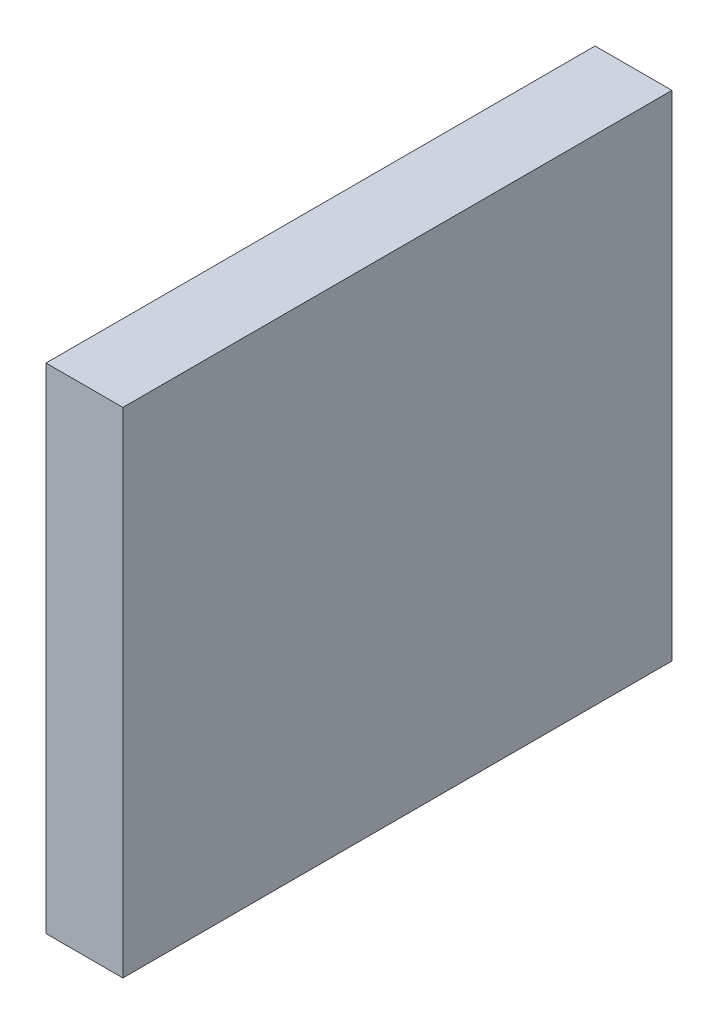
ISO-10303-21;
HEADER;
FILE_DESCRIPTION(('STEP AP214'),'2;1');
FILE_NAME('part.step','',(''),(''),'','','');
FILE_SCHEMA(('AUTOMOTIVE_DESIGN { 1 0 10303 214 1 1 1 1 }'));
ENDSEC;
DATA;
#1=APPLICATION_CONTEXT('core data for automotive mechanical design processes');
#2=APPLICATION_PROTOCOL_DEFINITION('international standard','automotive_design',2000,#1);
#3=PRODUCT_CONTEXT('',#1,'mechanical');
#4=PRODUCT('Part','Part','',(#3));
#5=PRODUCT_RELATED_PRODUCT_CATEGORY('part','',(#4));
#6=PRODUCT_DEFINITION_FORMATION('','',#4);
#7=PRODUCT_DEFINITION_CONTEXT('part definition',#1,'design');
#8=PRODUCT_DEFINITION('design','',#6,#7);
#9=PRODUCT_DEFINITION_SHAPE('','',#8);
#10=(LENGTH_UNIT() NAMED_UNIT(*) SI_UNIT(.MILLI.,.METRE.));
#11=(NAMED_UNIT(*) PLANE_ANGLE_UNIT() SI_UNIT($,.RADIAN.));
#12=(NAMED_UNIT(*) SI_UNIT($,.STERADIAN.) SOLID_ANGLE_UNIT());
#13=UNCERTAINTY_MEASURE_WITH_UNIT(LENGTH_MEASURE(1.E-05),#10,'distance_accuracy_value','');
#14=(GEOMETRIC_REPRESENTATION_CONTEXT(3) GLOBAL_UNCERTAINTY_ASSIGNED_CONTEXT((#13)) GLOBAL_UNIT_ASSIGNED_CONTEXT((#10,
#11,#12)) REPRESENTATION_CONTEXT('',''));
#15=CARTESIAN_POINT('',(0.,0.,0.));
#16=DIRECTION('',(0.,0.,1.));
#17=DIRECTION('',(1.,0.,0.));
#18=AXIS2_PLACEMENT_3D('',#15,#16,#17);
#19=CARTESIAN_POINT('',(7.,0.,0.));
#20=DIRECTION('',(0.,0.,-1.));
#21=DIRECTION('',(-1.,0.,0.));
#22=AXIS2_PLACEMENT_3D('',#19,#20,#21);
#23=PLANE('',#22);
#24=DIRECTION('',(0.,-1.,0.));
#25=VECTOR('',#24,1.);
#26=CARTESIAN_POINT('',(0.,0.,0.));
#27=LINE('',#26,#25);
#28=CARTESIAN_POINT('',(0.,45.,0.));
#29=VERTEX_POINT('',#28);
#30=CARTESIAN_POINT('',(0.,0.,0.));
#31=VERTEX_POINT('',#30);
#32=EDGE_CURVE('E96',#29,#31,#27,.T.);
#33=ORIENTED_EDGE('',*,*,#32,.T.);
#34=DIRECTION('',(-1.,0.,0.));
#35=VECTOR('',#34,1.);
#36=CARTESIAN_POINT('',(7.,0.,0.));
#37=LINE('',#36,#35);
#38=CARTESIAN_POINT('',(7.,0.,0.));
#39=VERTEX_POINT('',#38);
#40=EDGE_CURVE('E11',#39,#31,#37,.T.);
#41=ORIENTED_EDGE('',*,*,#40,.F.);
#42=DIRECTION('',(0.,-1.,0.));
#43=VECTOR('',#42,1.);
#44=CARTESIAN_POINT('',(7.,0.,0.));
#45=LINE('',#44,#43);
#46=CARTESIAN_POINT('',(7.,45.,0.));
#47=VERTEX_POINT('',#46);
#48=EDGE_CURVE('E84',#47,#39,#45,.T.);
#49=ORIENTED_EDGE('',*,*,#48,.F.);
#50=DIRECTION('',(-1.,0.,0.));
#51=VECTOR('',#50,1.);
#52=CARTESIAN_POINT('',(7.,45.,0.));
#53=LINE('',#52,#51);
#54=EDGE_CURVE('E92',#47,#29,#53,.T.);
#55=ORIENTED_EDGE('',*,*,#54,.T.);
#56=EDGE_LOOP('',(#33,#41,#49,#55));
#57=FACE_BOUND('',#56,.T.);
#58=ADVANCED_FACE('F33',(#57),#23,.F.);
#59=CARTESIAN_POINT('',(7.,0.,0.));
#60=DIRECTION('',(0.,1.,0.));
#61=DIRECTION('',(0.,0.,1.));
#62=AXIS2_PLACEMENT_3D('',#59,#60,#61);
#63=PLANE('',#62);
#64=DIRECTION('',(0.,0.,-1.));
#65=VECTOR('',#64,1.);
#66=CARTESIAN_POINT('',(0.,0.,0.));
#67=LINE('',#66,#65);
#68=CARTESIAN_POINT('',(0.,0.,-50.));
#69=VERTEX_POINT('',#68);
#70=EDGE_CURVE('E88',#31,#69,#67,.T.);
#71=ORIENTED_EDGE('',*,*,#70,.T.);
#72=DIRECTION('',(-1.,0.,0.));
#73=VECTOR('',#72,1.);
#74=CARTESIAN_POINT('',(7.,0.,-50.));
#75=LINE('',#74,#73);
#76=CARTESIAN_POINT('',(7.,0.,-50.));
#77=VERTEX_POINT('',#76);
#78=EDGE_CURVE('E41',#77,#69,#75,.T.);
#79=ORIENTED_EDGE('',*,*,#78,.F.);
#80=DIRECTION('',(0.,0.,-1.));
#81=VECTOR('',#80,1.);
#82=CARTESIAN_POINT('',(7.,0.,0.));
#83=LINE('',#82,#81);
#84=EDGE_CURVE('E79',#39,#77,#83,.T.);
#85=ORIENTED_EDGE('',*,*,#84,.F.);
#86=ORIENTED_EDGE('',*,*,#40,.T.);
#87=EDGE_LOOP('',(#71,#79,#85,#86));
#88=FACE_BOUND('',#87,.T.);
#89=ADVANCED_FACE('F87',(#88),#63,.F.);
#90=CARTESIAN_POINT('',(7.,0.,-50.));
#91=DIRECTION('',(0.,0.,1.));
#92=DIRECTION('',(1.,0.,0.));
#93=AXIS2_PLACEMENT_3D('',#90,#91,#92);
#94=PLANE('',#93);
#95=DIRECTION('',(0.,1.,0.));
#96=VECTOR('',#95,1.);
#97=CARTESIAN_POINT('',(0.,0.,-50.));
#98=LINE('',#97,#96);
#99=CARTESIAN_POINT('',(0.,45.,-50.));
#100=VERTEX_POINT('',#99);
#101=EDGE_CURVE('E66',#69,#100,#98,.T.);
#102=ORIENTED_EDGE('',*,*,#101,.T.);
#103=DIRECTION('',(-1.,0.,0.));
#104=VECTOR('',#103,1.);
#105=CARTESIAN_POINT('',(7.,45.,-50.));
#106=LINE('',#105,#104);
#107=CARTESIAN_POINT('',(7.,45.,-50.));
#108=VERTEX_POINT('',#107);
#109=EDGE_CURVE('E89',#108,#100,#106,.T.);
#110=ORIENTED_EDGE('',*,*,#109,.F.);
#111=DIRECTION('',(0.,1.,0.));
#112=VECTOR('',#111,1.);
#113=CARTESIAN_POINT('',(7.,0.,-50.));
#114=LINE('',#113,#112);
#115=EDGE_CURVE('E82',#77,#108,#114,.T.);
#116=ORIENTED_EDGE('',*,*,#115,.F.);
#117=ORIENTED_EDGE('',*,*,#78,.T.);
#118=EDGE_LOOP('',(#102,#110,#116,#117));
#119=FACE_BOUND('',#118,.T.);
#120=ADVANCED_FACE('F90',(#119),#94,.F.);
#121=CARTESIAN_POINT('',(7.,45.,0.));
#122=DIRECTION('',(0.,-1.,0.));
#123=DIRECTION('',(0.,0.,-1.));
#124=AXIS2_PLACEMENT_3D('',#121,#122,#123);
#125=PLANE('',#124);
#126=DIRECTION('',(0.,0.,1.));
#127=VECTOR('',#126,1.);
#128=CARTESIAN_POINT('',(0.,45.,0.));
#129=LINE('',#128,#127);
#130=EDGE_CURVE('E72',#100,#29,#129,.T.);
#131=ORIENTED_EDGE('',*,*,#130,.T.);
#132=ORIENTED_EDGE('',*,*,#54,.F.);
#133=DIRECTION('',(0.,0.,1.));
#134=VECTOR('',#133,1.);
#135=CARTESIAN_POINT('',(7.,45.,0.));
#136=LINE('',#135,#134);
#137=EDGE_CURVE('E49',#108,#47,#136,.T.);
#138=ORIENTED_EDGE('',*,*,#137,.F.);
#139=ORIENTED_EDGE('',*,*,#109,.T.);
#140=EDGE_LOOP('',(#131,#132,#138,#139));
#141=FACE_BOUND('',#140,.T.);
#142=ADVANCED_FACE('F103',(#141),#125,.F.);
#143=CARTESIAN_POINT('',(7.,0.,0.));
#144=DIRECTION('',(-1.,0.,0.));
#145=DIRECTION('',(0.,0.,1.));
#146=AXIS2_PLACEMENT_3D('',#143,#144,#145);
#147=PLANE('',#146);
#148=ORIENTED_EDGE('',*,*,#48,.T.);
#149=ORIENTED_EDGE('',*,*,#84,.T.);
#150=ORIENTED_EDGE('',*,*,#115,.T.);
#151=ORIENTED_EDGE('',*,*,#137,.T.);
#152=EDGE_LOOP('',(#148,#149,#150,#151));
#153=FACE_BOUND('',#152,.T.);
#154=ADVANCED_FACE('F80',(#153),#147,.F.);
#155=CARTESIAN_POINT('',(0.,0.,0.));
#156=DIRECTION('',(-1.,0.,0.));
#157=DIRECTION('',(0.,0.,1.));
#158=AXIS2_PLACEMENT_3D('',#155,#156,#157);
#159=PLANE('',#158);
#160=ORIENTED_EDGE('',*,*,#32,.F.);
#161=ORIENTED_EDGE('',*,*,#130,.F.);
#162=ORIENTED_EDGE('',*,*,#101,.F.);
#163=ORIENTED_EDGE('',*,*,#70,.F.);
#164=EDGE_LOOP('',(#160,#161,#162,#163));
#165=FACE_BOUND('',#164,.T.);
#166=ADVANCED_FACE('F106',(#165),#159,.T.);
#167=CLOSED_SHELL('',(#58,#89,#120,#142,#154,#166));
#168=MANIFOLD_SOLID_BREP('B2',#167);
#169=ADVANCED_BREP_SHAPE_REPRESENTATION('',(#18,#168),#14);
#170=SHAPE_DEFINITION_REPRESENTATION(#9,#169);
ENDSEC;
END-ISO-10303-21;
